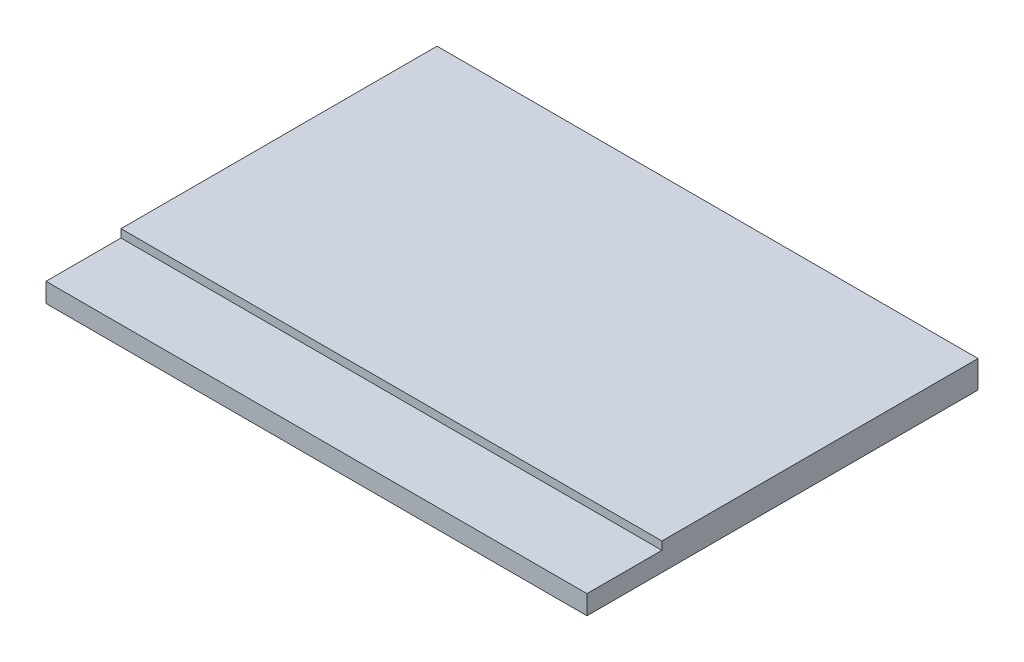
ISO-10303-21;
HEADER;
FILE_DESCRIPTION(('STEP AP214'),'2;1');
FILE_NAME('part.step','',(''),(''),'','','');
FILE_SCHEMA(('AUTOMOTIVE_DESIGN { 1 0 10303 214 1 1 1 1 }'));
ENDSEC;
DATA;
#1=APPLICATION_CONTEXT('core data for automotive mechanical design processes');
#2=APPLICATION_PROTOCOL_DEFINITION('international standard','automotive_design',2000,#1);
#3=PRODUCT_CONTEXT('',#1,'mechanical');
#4=PRODUCT('Part','Part','',(#3));
#5=PRODUCT_RELATED_PRODUCT_CATEGORY('part','',(#4));
#6=PRODUCT_DEFINITION_FORMATION('','',#4);
#7=PRODUCT_DEFINITION_CONTEXT('part definition',#1,'design');
#8=PRODUCT_DEFINITION('design','',#6,#7);
#9=PRODUCT_DEFINITION_SHAPE('','',#8);
#10=(LENGTH_UNIT() NAMED_UNIT(*) SI_UNIT(.MILLI.,.METRE.));
#11=(NAMED_UNIT(*) PLANE_ANGLE_UNIT() SI_UNIT($,.RADIAN.));
#12=(NAMED_UNIT(*) SI_UNIT($,.STERADIAN.) SOLID_ANGLE_UNIT());
#13=UNCERTAINTY_MEASURE_WITH_UNIT(LENGTH_MEASURE(1.E-05),#10,'distance_accuracy_value','');
#14=(GEOMETRIC_REPRESENTATION_CONTEXT(3) GLOBAL_UNCERTAINTY_ASSIGNED_CONTEXT((#13)) GLOBAL_UNIT_ASSIGNED_CONTEXT((#10,
#11,#12)) REPRESENTATION_CONTEXT('',''));
#15=CARTESIAN_POINT('',(0.,0.,0.));
#16=DIRECTION('',(0.,0.,1.));
#17=DIRECTION('',(1.,0.,0.));
#18=AXIS2_PLACEMENT_3D('',#15,#16,#17);
#19=CARTESIAN_POINT('',(13.35,1.35,9.65));
#20=DIRECTION('',(-1.,0.,0.));
#21=DIRECTION('',(0.,0.,1.));
#22=AXIS2_PLACEMENT_3D('',#19,#20,#21);
#23=PLANE('',#22);
#24=DIRECTION('',(0.,0.,-1.));
#25=VECTOR('',#24,1.);
#26=CARTESIAN_POINT('',(13.35,1.35,9.65));
#27=LINE('',#26,#25);
#28=CARTESIAN_POINT('',(13.35,1.35,5.95));
#29=VERTEX_POINT('',#28);
#30=CARTESIAN_POINT('',(13.35,1.35,-9.65));
#31=VERTEX_POINT('',#30);
#32=EDGE_CURVE('E100',#29,#31,#27,.T.);
#33=ORIENTED_EDGE('',*,*,#32,.F.);
#34=DIRECTION('',(0.,1.,0.));
#35=VECTOR('',#34,1.);
#36=CARTESIAN_POINT('',(13.35,0.95,5.95));
#37=LINE('',#36,#35);
#38=CARTESIAN_POINT('',(13.35,0.95,5.95));
#39=VERTEX_POINT('',#38);
#40=EDGE_CURVE('E46',#39,#29,#37,.T.);
#41=ORIENTED_EDGE('',*,*,#40,.F.);
#42=DIRECTION('',(0.,0.,-1.));
#43=VECTOR('',#42,1.);
#44=CARTESIAN_POINT('',(13.35,0.95,9.65));
#45=LINE('',#44,#43);
#46=CARTESIAN_POINT('',(13.35,0.95,9.65));
#47=VERTEX_POINT('',#46);
#48=EDGE_CURVE('E82',#47,#39,#45,.T.);
#49=ORIENTED_EDGE('',*,*,#48,.F.);
#50=DIRECTION('',(0.,-1.,0.));
#51=VECTOR('',#50,1.);
#52=CARTESIAN_POINT('',(13.35,1.35,9.65));
#53=LINE('',#52,#51);
#54=CARTESIAN_POINT('',(13.35,0.,9.65));
#55=VERTEX_POINT('',#54);
#56=EDGE_CURVE('E75',#47,#55,#53,.T.);
#57=ORIENTED_EDGE('',*,*,#56,.T.);
#58=DIRECTION('',(0.,0.,-1.));
#59=VECTOR('',#58,1.);
#60=CARTESIAN_POINT('',(13.35,0.,9.65));
#61=LINE('',#60,#59);
#62=CARTESIAN_POINT('',(13.35,0.,-9.65));
#63=VERTEX_POINT('',#62);
#64=EDGE_CURVE('E79',#55,#63,#61,.T.);
#65=ORIENTED_EDGE('',*,*,#64,.T.);
#66=DIRECTION('',(0.,-1.,0.));
#67=VECTOR('',#66,1.);
#68=CARTESIAN_POINT('',(13.35,1.35,-9.65));
#69=LINE('',#68,#67);
#70=EDGE_CURVE('E11',#31,#63,#69,.T.);
#71=ORIENTED_EDGE('',*,*,#70,.F.);
#72=EDGE_LOOP('',(#33,#41,#49,#57,#65,#71));
#73=FACE_BOUND('',#72,.T.);
#74=ADVANCED_FACE('F32',(#73),#23,.F.);
#75=CARTESIAN_POINT('',(13.35,1.35,-9.65));
#76=DIRECTION('',(0.,0.,1.));
#77=DIRECTION('',(1.,0.,0.));
#78=AXIS2_PLACEMENT_3D('',#75,#76,#77);
#79=PLANE('',#78);
#80=DIRECTION('',(-1.,0.,0.));
#81=VECTOR('',#80,1.);
#82=CARTESIAN_POINT('',(13.35,0.,-9.65));
#83=LINE('',#82,#81);
#84=CARTESIAN_POINT('',(-13.35,0.,-9.65));
#85=VERTEX_POINT('',#84);
#86=EDGE_CURVE('E94',#63,#85,#83,.T.);
#87=ORIENTED_EDGE('',*,*,#86,.T.);
#88=DIRECTION('',(0.,-1.,0.));
#89=VECTOR('',#88,1.);
#90=CARTESIAN_POINT('',(-13.35,1.35,-9.65));
#91=LINE('',#90,#89);
#92=CARTESIAN_POINT('',(-13.35,1.35,-9.65));
#93=VERTEX_POINT('',#92);
#94=EDGE_CURVE('E39',#93,#85,#91,.T.);
#95=ORIENTED_EDGE('',*,*,#94,.F.);
#96=DIRECTION('',(-1.,0.,0.));
#97=VECTOR('',#96,1.);
#98=CARTESIAN_POINT('',(13.35,1.35,-9.65));
#99=LINE('',#98,#97);
#100=EDGE_CURVE('E103',#31,#93,#99,.T.);
#101=ORIENTED_EDGE('',*,*,#100,.F.);
#102=ORIENTED_EDGE('',*,*,#70,.T.);
#103=EDGE_LOOP('',(#87,#95,#101,#102));
#104=FACE_BOUND('',#103,.T.);
#105=ADVANCED_FACE('F112',(#104),#79,.F.);
#106=CARTESIAN_POINT('',(-13.35,1.35,9.65));
#107=DIRECTION('',(-1.,0.,0.));
#108=DIRECTION('',(0.,0.,1.));
#109=AXIS2_PLACEMENT_3D('',#106,#107,#108);
#110=PLANE('',#109);
#111=DIRECTION('',(0.,1.,0.));
#112=VECTOR('',#111,1.);
#113=CARTESIAN_POINT('',(-13.35,0.95,5.95));
#114=LINE('',#113,#112);
#115=CARTESIAN_POINT('',(-13.35,0.95,5.95));
#116=VERTEX_POINT('',#115);
#117=CARTESIAN_POINT('',(-13.35,1.35,5.95));
#118=VERTEX_POINT('',#117);
#119=EDGE_CURVE('E95',#116,#118,#114,.T.);
#120=ORIENTED_EDGE('',*,*,#119,.T.);
#121=DIRECTION('',(0.,0.,-1.));
#122=VECTOR('',#121,1.);
#123=CARTESIAN_POINT('',(-13.35,1.35,9.65));
#124=LINE('',#123,#122);
#125=EDGE_CURVE('E55',#118,#93,#124,.T.);
#126=ORIENTED_EDGE('',*,*,#125,.T.);
#127=ORIENTED_EDGE('',*,*,#94,.T.);
#128=DIRECTION('',(0.,0.,-1.));
#129=VECTOR('',#128,1.);
#130=CARTESIAN_POINT('',(-13.35,0.,9.65));
#131=LINE('',#130,#129);
#132=CARTESIAN_POINT('',(-13.35,0.,9.65));
#133=VERTEX_POINT('',#132);
#134=EDGE_CURVE('E101',#133,#85,#131,.T.);
#135=ORIENTED_EDGE('',*,*,#134,.F.);
#136=DIRECTION('',(0.,-1.,0.));
#137=VECTOR('',#136,1.);
#138=CARTESIAN_POINT('',(-13.35,1.35,9.65));
#139=LINE('',#138,#137);
#140=CARTESIAN_POINT('',(-13.35,0.95,9.65));
#141=VERTEX_POINT('',#140);
#142=EDGE_CURVE('E86',#141,#133,#139,.T.);
#143=ORIENTED_EDGE('',*,*,#142,.F.);
#144=DIRECTION('',(0.,0.,1.));
#145=VECTOR('',#144,1.);
#146=CARTESIAN_POINT('',(-13.35,0.95,9.65));
#147=LINE('',#146,#145);
#148=EDGE_CURVE('E121',#116,#141,#147,.T.);
#149=ORIENTED_EDGE('',*,*,#148,.F.);
#150=EDGE_LOOP('',(#120,#126,#127,#135,#143,#149));
#151=FACE_BOUND('',#150,.T.);
#152=ADVANCED_FACE('F109',(#151),#110,.T.);
#153=CARTESIAN_POINT('',(13.35,1.35,9.65));
#154=DIRECTION('',(0.,0.,1.));
#155=DIRECTION('',(1.,0.,0.));
#156=AXIS2_PLACEMENT_3D('',#153,#154,#155);
#157=PLANE('',#156);
#158=DIRECTION('',(1.,0.,0.));
#159=VECTOR('',#158,1.);
#160=CARTESIAN_POINT('',(-13.35,0.95,9.65));
#161=LINE('',#160,#159);
#162=EDGE_CURVE('E125',#141,#47,#161,.T.);
#163=ORIENTED_EDGE('',*,*,#162,.F.);
#164=ORIENTED_EDGE('',*,*,#142,.T.);
#165=DIRECTION('',(-1.,0.,0.));
#166=VECTOR('',#165,1.);
#167=CARTESIAN_POINT('',(13.35,0.,9.65));
#168=LINE('',#167,#166);
#169=EDGE_CURVE('E92',#55,#133,#168,.T.);
#170=ORIENTED_EDGE('',*,*,#169,.F.);
#171=ORIENTED_EDGE('',*,*,#56,.F.);
#172=EDGE_LOOP('',(#163,#164,#170,#171));
#173=FACE_BOUND('',#172,.T.);
#174=ADVANCED_FACE('F97',(#173),#157,.T.);
#175=CARTESIAN_POINT('',(0.,1.35,0.));
#176=DIRECTION('',(0.,1.,0.));
#177=DIRECTION('',(0.,0.,1.));
#178=AXIS2_PLACEMENT_3D('',#175,#176,#177);
#179=PLANE('',#178);
#180=DIRECTION('',(-1.,0.,0.));
#181=VECTOR('',#180,1.);
#182=CARTESIAN_POINT('',(-13.35,1.35,5.95));
#183=LINE('',#182,#181);
#184=EDGE_CURVE('E119',#29,#118,#183,.T.);
#185=ORIENTED_EDGE('',*,*,#184,.F.);
#186=ORIENTED_EDGE('',*,*,#32,.T.);
#187=ORIENTED_EDGE('',*,*,#100,.T.);
#188=ORIENTED_EDGE('',*,*,#125,.F.);
#189=EDGE_LOOP('',(#185,#186,#187,#188));
#190=FACE_BOUND('',#189,.T.);
#191=ADVANCED_FACE('F142',(#190),#179,.T.);
#192=CARTESIAN_POINT('',(0.,0.,0.));
#193=DIRECTION('',(0.,1.,0.));
#194=DIRECTION('',(0.,0.,1.));
#195=AXIS2_PLACEMENT_3D('',#192,#193,#194);
#196=PLANE('',#195);
#197=ORIENTED_EDGE('',*,*,#64,.F.);
#198=ORIENTED_EDGE('',*,*,#169,.T.);
#199=ORIENTED_EDGE('',*,*,#134,.T.);
#200=ORIENTED_EDGE('',*,*,#86,.F.);
#201=EDGE_LOOP('',(#197,#198,#199,#200));
#202=FACE_BOUND('',#201,.T.);
#203=ADVANCED_FACE('F90',(#202),#196,.F.);
#204=CARTESIAN_POINT('',(-13.35,0.95,5.95));
#205=DIRECTION('',(0.,0.,-1.));
#206=DIRECTION('',(-1.,0.,0.));
#207=AXIS2_PLACEMENT_3D('',#204,#205,#206);
#208=PLANE('',#207);
#209=ORIENTED_EDGE('',*,*,#184,.T.);
#210=ORIENTED_EDGE('',*,*,#119,.F.);
#211=DIRECTION('',(-1.,0.,0.));
#212=VECTOR('',#211,1.);
#213=CARTESIAN_POINT('',(-13.35,0.95,5.95));
#214=LINE('',#213,#212);
#215=EDGE_CURVE('E117',#39,#116,#214,.T.);
#216=ORIENTED_EDGE('',*,*,#215,.F.);
#217=ORIENTED_EDGE('',*,*,#40,.T.);
#218=EDGE_LOOP('',(#209,#210,#216,#217));
#219=FACE_BOUND('',#218,.T.);
#220=ADVANCED_FACE('F140',(#219),#208,.F.);
#221=CARTESIAN_POINT('',(0.,0.95,0.));
#222=DIRECTION('',(0.,-1.,0.));
#223=DIRECTION('',(0.,0.,-1.));
#224=AXIS2_PLACEMENT_3D('',#221,#222,#223);
#225=PLANE('',#224);
#226=ORIENTED_EDGE('',*,*,#148,.T.);
#227=ORIENTED_EDGE('',*,*,#162,.T.);
#228=ORIENTED_EDGE('',*,*,#48,.T.);
#229=ORIENTED_EDGE('',*,*,#215,.T.);
#230=EDGE_LOOP('',(#226,#227,#228,#229));
#231=FACE_BOUND('',#230,.T.);
#232=ADVANCED_FACE('F132',(#231),#225,.F.);
#233=CLOSED_SHELL('',(#74,#105,#152,#174,#191,#203,#220,#232));
#234=MANIFOLD_SOLID_BREP('B2',#233);
#235=ADVANCED_BREP_SHAPE_REPRESENTATION('',(#18,#234),#14);
#236=SHAPE_DEFINITION_REPRESENTATION(#9,#235);
ENDSEC;
END-ISO-10303-21;
